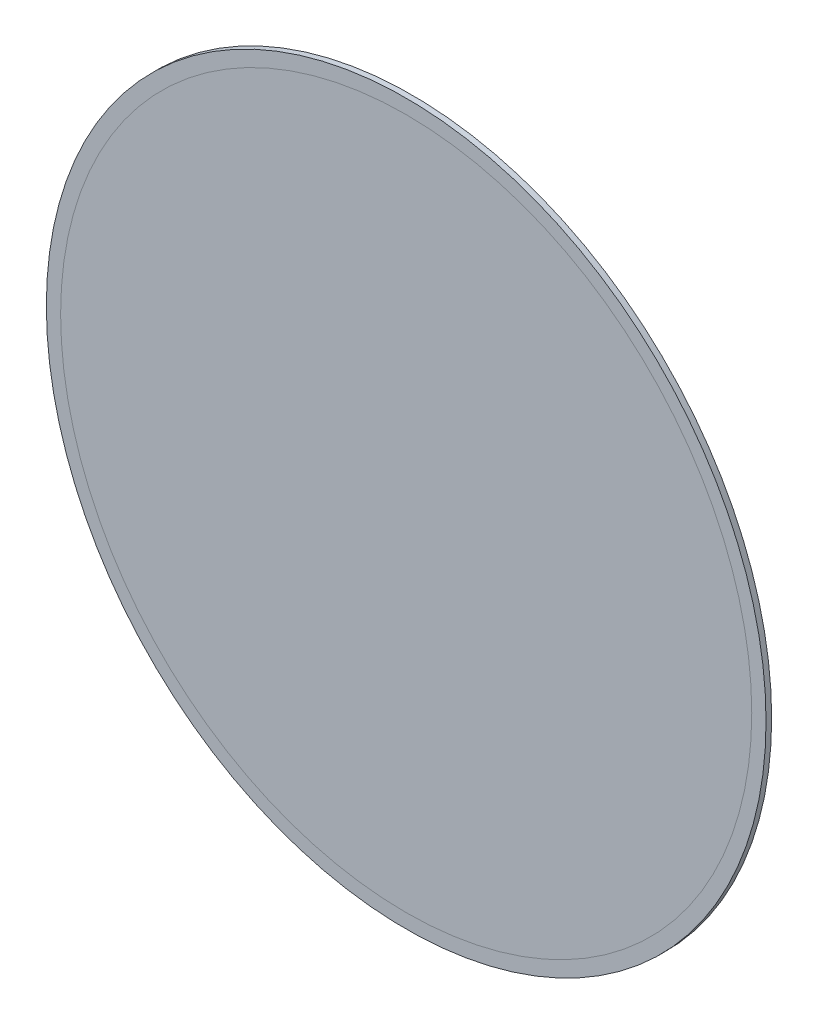
ISO-10303-21;
HEADER;
FILE_DESCRIPTION(('STEP AP214'),'2;1');
FILE_NAME('part.step','',(''),(''),'','','');
FILE_SCHEMA(('AUTOMOTIVE_DESIGN { 1 0 10303 214 1 1 1 1 }'));
ENDSEC;
DATA;
#1=APPLICATION_CONTEXT('core data for automotive mechanical design processes');
#2=APPLICATION_PROTOCOL_DEFINITION('international standard','automotive_design',2000,#1);
#3=PRODUCT_CONTEXT('',#1,'mechanical');
#4=PRODUCT('Part','Part','',(#3));
#5=PRODUCT_RELATED_PRODUCT_CATEGORY('part','',(#4));
#6=PRODUCT_DEFINITION_FORMATION('','',#4);
#7=PRODUCT_DEFINITION_CONTEXT('part definition',#1,'design');
#8=PRODUCT_DEFINITION('design','',#6,#7);
#9=PRODUCT_DEFINITION_SHAPE('','',#8);
#10=(LENGTH_UNIT() NAMED_UNIT(*) SI_UNIT(.MILLI.,.METRE.));
#11=(NAMED_UNIT(*) PLANE_ANGLE_UNIT() SI_UNIT($,.RADIAN.));
#12=(NAMED_UNIT(*) SI_UNIT($,.STERADIAN.) SOLID_ANGLE_UNIT());
#13=UNCERTAINTY_MEASURE_WITH_UNIT(LENGTH_MEASURE(1.E-05),#10,'distance_accuracy_value','');
#14=(GEOMETRIC_REPRESENTATION_CONTEXT(3) GLOBAL_UNCERTAINTY_ASSIGNED_CONTEXT((#13)) GLOBAL_UNIT_ASSIGNED_CONTEXT((#10,
#11,#12)) REPRESENTATION_CONTEXT('',''));
#15=CARTESIAN_POINT('',(0.,0.,0.));
#16=DIRECTION('',(0.,0.,1.));
#17=DIRECTION('',(1.,0.,0.));
#18=AXIS2_PLACEMENT_3D('',#15,#16,#17);
#19=CARTESIAN_POINT('',(0.,0.,0.));
#20=DIRECTION('',(0.,0.,1.));
#21=DIRECTION('',(1.,0.,0.));
#22=AXIS2_PLACEMENT_3D('',#19,#20,#21);
#23=PLANE('',#22);
#24=CARTESIAN_POINT('',(0.,0.,0.));
#25=DIRECTION('',(0.,0.,1.));
#26=DIRECTION('',(1.,0.,0.));
#27=AXIS2_PLACEMENT_3D('',#24,#25,#26);
#28=CIRCLE('',#27,320.);
#29=CARTESIAN_POINT('',(320.,0.,0.));
#30=VERTEX_POINT('',#29);
#31=EDGE_CURVE('E54',#30,#30,#28,.T.);
#32=ORIENTED_EDGE('',*,*,#31,.F.);
#33=EDGE_LOOP('',(#32));
#34=FACE_BOUND('',#33,.T.);
#35=CARTESIAN_POINT('',(0.,0.,0.));
#36=DIRECTION('',(0.,0.,1.));
#37=DIRECTION('',(1.,0.,0.));
#38=AXIS2_PLACEMENT_3D('',#35,#36,#37);
#39=CIRCLE('',#38,307.3);
#40=CARTESIAN_POINT('',(307.3,0.,0.));
#41=VERTEX_POINT('',#40);
#42=EDGE_CURVE('E10',#41,#41,#39,.F.);
#43=ORIENTED_EDGE('',*,*,#42,.F.);
#44=EDGE_LOOP('',(#43));
#45=FACE_BOUND('',#44,.T.);
#46=ADVANCED_FACE('F37',(#34,#45),#23,.F.);
#47=CARTESIAN_POINT('',(0.,0.,5.));
#48=DIRECTION('',(0.,0.,1.));
#49=DIRECTION('',(1.,0.,0.));
#50=AXIS2_PLACEMENT_3D('',#47,#48,#49);
#51=PLANE('',#50);
#52=CARTESIAN_POINT('',(0.,0.,5.));
#53=DIRECTION('',(0.,0.,1.));
#54=DIRECTION('',(1.,0.,0.));
#55=AXIS2_PLACEMENT_3D('',#52,#53,#54);
#56=CIRCLE('',#55,320.);
#57=CARTESIAN_POINT('',(320.,0.,5.));
#58=VERTEX_POINT('',#57);
#59=EDGE_CURVE('E52',#58,#58,#56,.T.);
#60=ORIENTED_EDGE('',*,*,#59,.T.);
#61=EDGE_LOOP('',(#60));
#62=FACE_BOUND('',#61,.T.);
#63=CARTESIAN_POINT('',(0.,0.,5.));
#64=DIRECTION('',(0.,0.,1.));
#65=DIRECTION('',(1.,0.,0.));
#66=AXIS2_PLACEMENT_3D('',#63,#64,#65);
#67=CIRCLE('',#66,307.3);
#68=CARTESIAN_POINT('',(307.3,0.,5.));
#69=VERTEX_POINT('',#68);
#70=EDGE_CURVE('E41',#69,#69,#67,.F.);
#71=ORIENTED_EDGE('',*,*,#70,.T.);
#72=EDGE_LOOP('',(#71));
#73=FACE_BOUND('',#72,.T.);
#74=ADVANCED_FACE('F60',(#62,#73),#51,.T.);
#75=CARTESIAN_POINT('',(0.,0.,5.));
#76=DIRECTION('',(0.,0.,-1.));
#77=DIRECTION('',(-1.,0.,0.));
#78=AXIS2_PLACEMENT_3D('',#75,#76,#77);
#79=CYLINDRICAL_SURFACE('',#78,320.);
#80=ORIENTED_EDGE('',*,*,#59,.F.);
#81=EDGE_LOOP('',(#80));
#82=FACE_BOUND('',#81,.T.);
#83=ORIENTED_EDGE('',*,*,#31,.T.);
#84=EDGE_LOOP('',(#83));
#85=FACE_BOUND('',#84,.T.);
#86=ADVANCED_FACE('F39',(#82,#85),#79,.T.);
#87=ORIENTED_EDGE('',*,*,#70,.F.);
#88=EDGE_LOOP('',(#87));
#89=FACE_BOUND('',#88,.T.);
#90=ADVANCED_FACE('F65',(#89),#51,.T.);
#91=ORIENTED_EDGE('',*,*,#42,.T.);
#92=EDGE_LOOP('',(#91));
#93=FACE_BOUND('',#92,.T.);
#94=ADVANCED_FACE('F70',(#93),#23,.F.);
#95=CLOSED_SHELL('',(#46,#74,#86,#90,#94));
#96=MANIFOLD_SOLID_BREP('B2',#95);
#97=ADVANCED_BREP_SHAPE_REPRESENTATION('',(#18,#96),#14);
#98=SHAPE_DEFINITION_REPRESENTATION(#9,#97);
ENDSEC;
END-ISO-10303-21;
